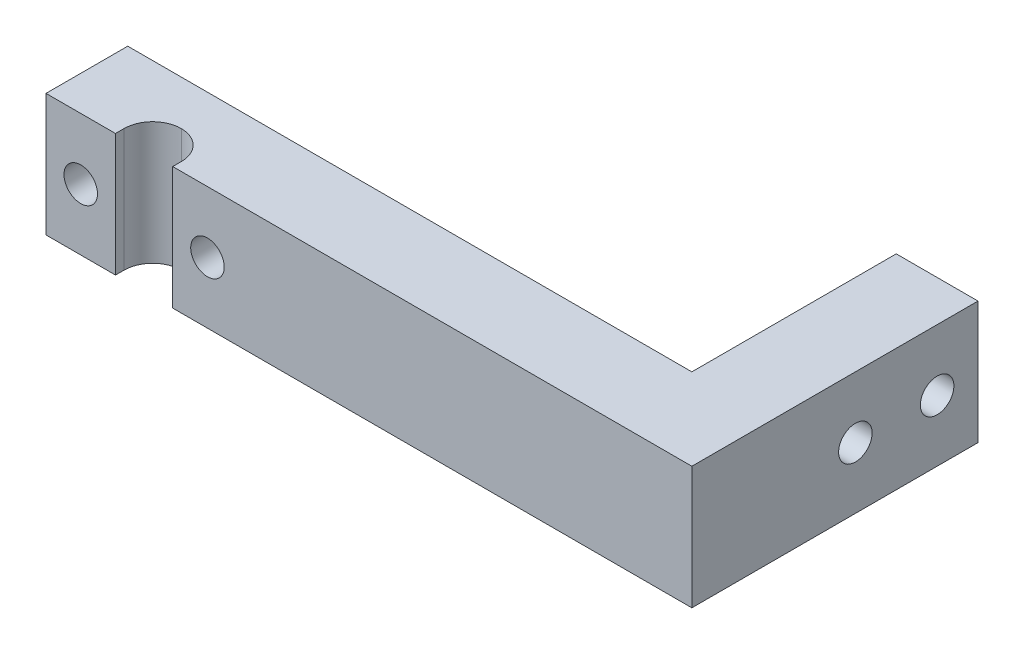
ISO-10303-21;
HEADER;
FILE_DESCRIPTION(('STEP AP214'),'2;1');
FILE_NAME('part.step','',(''),(''),'','','');
FILE_SCHEMA(('AUTOMOTIVE_DESIGN { 1 0 10303 214 1 1 1 1 }'));
ENDSEC;
DATA;
#1=APPLICATION_CONTEXT('core data for automotive mechanical design processes');
#2=APPLICATION_PROTOCOL_DEFINITION('international standard','automotive_design',2000,#1);
#3=PRODUCT_CONTEXT('',#1,'mechanical');
#4=PRODUCT('Part','Part','',(#3));
#5=PRODUCT_RELATED_PRODUCT_CATEGORY('part','',(#4));
#6=PRODUCT_DEFINITION_FORMATION('','',#4);
#7=PRODUCT_DEFINITION_CONTEXT('part definition',#1,'design');
#8=PRODUCT_DEFINITION('design','',#6,#7);
#9=PRODUCT_DEFINITION_SHAPE('','',#8);
#10=(LENGTH_UNIT() NAMED_UNIT(*) SI_UNIT(.MILLI.,.METRE.));
#11=(NAMED_UNIT(*) PLANE_ANGLE_UNIT() SI_UNIT($,.RADIAN.));
#12=(NAMED_UNIT(*) SI_UNIT($,.STERADIAN.) SOLID_ANGLE_UNIT());
#13=UNCERTAINTY_MEASURE_WITH_UNIT(LENGTH_MEASURE(1.E-05),#10,'distance_accuracy_value','');
#14=(GEOMETRIC_REPRESENTATION_CONTEXT(3) GLOBAL_UNCERTAINTY_ASSIGNED_CONTEXT((#13)) GLOBAL_UNIT_ASSIGNED_CONTEXT((#10,
#11,#12)) REPRESENTATION_CONTEXT('',''));
#15=CARTESIAN_POINT('',(0.,0.,0.));
#16=DIRECTION('',(0.,0.,1.));
#17=DIRECTION('',(1.,0.,0.));
#18=AXIS2_PLACEMENT_3D('',#15,#16,#17);
#19=CARTESIAN_POINT('',(-22.986013986014,30.,-8.6013986013986));
#20=DIRECTION('',(1.,0.,0.));
#21=DIRECTION('',(0.,0.,-1.));
#22=AXIS2_PLACEMENT_3D('',#19,#20,#21);
#23=PLANE('',#22);
#24=DIRECTION('',(0.,0.,1.));
#25=VECTOR('',#24,1.);
#26=CARTESIAN_POINT('',(-22.986013986014,0.,-8.6013986013986));
#27=LINE('',#26,#25);
#28=CARTESIAN_POINT('',(-22.986013986014,0.,-8.6013986013986));
#29=VERTEX_POINT('',#28);
#30=CARTESIAN_POINT('',(-22.986013986014,0.,11.3986013986014));
#31=VERTEX_POINT('',#30);
#32=EDGE_CURVE('E160',#29,#31,#27,.T.);
#33=ORIENTED_EDGE('',*,*,#32,.T.);
#34=DIRECTION('',(0.,-1.,0.));
#35=VECTOR('',#34,1.);
#36=CARTESIAN_POINT('',(-22.986013986014,30.,11.3986013986014));
#37=LINE('',#36,#35);
#38=CARTESIAN_POINT('',(-22.986013986014,30.,11.3986013986014));
#39=VERTEX_POINT('',#38);
#40=EDGE_CURVE('E188',#39,#31,#37,.T.);
#41=ORIENTED_EDGE('',*,*,#40,.F.);
#42=DIRECTION('',(0.,0.,1.));
#43=VECTOR('',#42,1.);
#44=CARTESIAN_POINT('',(-22.986013986014,30.,-8.6013986013986));
#45=LINE('',#44,#43);
#46=CARTESIAN_POINT('',(-22.986013986014,30.,-8.6013986013986));
#47=VERTEX_POINT('',#46);
#48=EDGE_CURVE('E128',#47,#39,#45,.T.);
#49=ORIENTED_EDGE('',*,*,#48,.F.);
#50=DIRECTION('',(0.,-1.,0.));
#51=VECTOR('',#50,1.);
#52=CARTESIAN_POINT('',(-22.986013986014,30.,-8.6013986013986));
#53=LINE('',#52,#51);
#54=EDGE_CURVE('E127',#47,#29,#53,.T.);
#55=ORIENTED_EDGE('',*,*,#54,.T.);
#56=EDGE_LOOP('',(#33,#41,#49,#55));
#57=FACE_BOUND('',#56,.T.);
#58=ADVANCED_FACE('F35',(#57),#23,.F.);
#59=CARTESIAN_POINT('',(-22.986013986014,30.,11.3986013986014));
#60=DIRECTION('',(0.,0.,-1.));
#61=DIRECTION('',(-1.,0.,0.));
#62=AXIS2_PLACEMENT_3D('',#59,#60,#61);
#63=PLANE('',#62);
#64=CARTESIAN_POINT('',(-14.486013986014,15.,11.3986013986014));
#65=DIRECTION('',(0.,0.,1.));
#66=DIRECTION('',(1.,0.,0.));
#67=AXIS2_PLACEMENT_3D('',#64,#65,#66);
#68=CIRCLE('',#67,4.1);
#69=CARTESIAN_POINT('',(-10.386013986014,15.,11.3986013986014));
#70=VERTEX_POINT('',#69);
#71=EDGE_CURVE('E155',#70,#70,#68,.T.);
#72=ORIENTED_EDGE('',*,*,#71,.F.);
#73=EDGE_LOOP('',(#72));
#74=FACE_BOUND('',#73,.T.);
#75=DIRECTION('',(1.,0.,0.));
#76=VECTOR('',#75,1.);
#77=CARTESIAN_POINT('',(-22.986013986014,0.,11.3986013986014));
#78=LINE('',#77,#76);
#79=CARTESIAN_POINT('',(-5.98601398601399,0.,11.3986013986014));
#80=VERTEX_POINT('',#79);
#81=EDGE_CURVE('E173',#31,#80,#78,.T.);
#82=ORIENTED_EDGE('',*,*,#81,.T.);
#83=DIRECTION('',(0.,-1.,0.));
#84=VECTOR('',#83,1.);
#85=CARTESIAN_POINT('',(-5.98601398601399,30.,11.3986013986014));
#86=LINE('',#85,#84);
#87=CARTESIAN_POINT('',(-5.98601398601399,30.,11.3986013986014));
#88=VERTEX_POINT('',#87);
#89=EDGE_CURVE('E185',#88,#80,#86,.T.);
#90=ORIENTED_EDGE('',*,*,#89,.F.);
#91=DIRECTION('',(1.,0.,0.));
#92=VECTOR('',#91,1.);
#93=CARTESIAN_POINT('',(-22.986013986014,30.,11.3986013986014));
#94=LINE('',#93,#92);
#95=EDGE_CURVE('E163',#39,#88,#94,.T.);
#96=ORIENTED_EDGE('',*,*,#95,.F.);
#97=ORIENTED_EDGE('',*,*,#40,.T.);
#98=EDGE_LOOP('',(#82,#90,#96,#97));
#99=FACE_BOUND('',#98,.T.);
#100=ADVANCED_FACE('F261',(#74,#99),#63,.F.);
#101=CARTESIAN_POINT('',(-5.98601398601399,30.,11.3986013986014));
#102=DIRECTION('',(-1.,0.,0.));
#103=DIRECTION('',(0.,0.,1.));
#104=AXIS2_PLACEMENT_3D('',#101,#102,#103);
#105=PLANE('',#104);
#106=DIRECTION('',(0.,0.,-1.));
#107=VECTOR('',#106,1.);
#108=CARTESIAN_POINT('',(-5.98601398601399,0.,11.3986013986014));
#109=LINE('',#108,#107);
#110=CARTESIAN_POINT('',(-5.98601398601399,0.,9.30769230769231));
#111=VERTEX_POINT('',#110);
#112=EDGE_CURVE('E175',#80,#111,#109,.T.);
#113=ORIENTED_EDGE('',*,*,#112,.T.);
#114=DIRECTION('',(0.,-1.,0.));
#115=VECTOR('',#114,1.);
#116=CARTESIAN_POINT('',(-5.98601398601399,30.,9.30769230769231));
#117=LINE('',#116,#115);
#118=CARTESIAN_POINT('',(-5.98601398601399,30.,9.30769230769231));
#119=VERTEX_POINT('',#118);
#120=EDGE_CURVE('E192',#111,#119,#117,.F.);
#121=ORIENTED_EDGE('',*,*,#120,.T.);
#122=DIRECTION('',(0.,0.,-1.));
#123=VECTOR('',#122,1.);
#124=CARTESIAN_POINT('',(-5.98601398601399,30.,11.3986013986014));
#125=LINE('',#124,#123);
#126=EDGE_CURVE('E165',#88,#119,#125,.T.);
#127=ORIENTED_EDGE('',*,*,#126,.F.);
#128=ORIENTED_EDGE('',*,*,#89,.T.);
#129=EDGE_LOOP('',(#113,#121,#127,#128));
#130=FACE_BOUND('',#129,.T.);
#131=ADVANCED_FACE('F211',(#130),#105,.F.);
#132=CARTESIAN_POINT('',(8.01398601398601,30.,2.30769230769231));
#133=DIRECTION('',(1.,0.,0.));
#134=DIRECTION('',(0.,0.,-1.));
#135=AXIS2_PLACEMENT_3D('',#132,#133,#134);
#136=PLANE('',#135);
#137=DIRECTION('',(0.,0.,1.));
#138=VECTOR('',#137,1.);
#139=CARTESIAN_POINT('',(8.01398601398601,30.,2.30769230769231));
#140=LINE('',#139,#138);
#141=CARTESIAN_POINT('',(8.01398601398601,30.,9.30769230769231));
#142=VERTEX_POINT('',#141);
#143=CARTESIAN_POINT('',(8.01398601398601,30.,11.3986013986014));
#144=VERTEX_POINT('',#143);
#145=EDGE_CURVE('E167',#142,#144,#140,.T.);
#146=ORIENTED_EDGE('',*,*,#145,.F.);
#147=DIRECTION('',(0.,-1.,0.));
#148=VECTOR('',#147,1.);
#149=CARTESIAN_POINT('',(8.01398601398601,0.,9.30769230769231));
#150=LINE('',#149,#148);
#151=CARTESIAN_POINT('',(8.01398601398601,0.,9.30769230769231));
#152=VERTEX_POINT('',#151);
#153=EDGE_CURVE('E197',#142,#152,#150,.T.);
#154=ORIENTED_EDGE('',*,*,#153,.T.);
#155=DIRECTION('',(0.,0.,1.));
#156=VECTOR('',#155,1.);
#157=CARTESIAN_POINT('',(8.01398601398601,0.,2.30769230769231));
#158=LINE('',#157,#156);
#159=CARTESIAN_POINT('',(8.01398601398601,0.,11.3986013986014));
#160=VERTEX_POINT('',#159);
#161=EDGE_CURVE('E178',#152,#160,#158,.T.);
#162=ORIENTED_EDGE('',*,*,#161,.T.);
#163=DIRECTION('',(0.,-1.,0.));
#164=VECTOR('',#163,1.);
#165=CARTESIAN_POINT('',(8.01398601398601,30.,11.3986013986014));
#166=LINE('',#165,#164);
#167=EDGE_CURVE('E171',#144,#160,#166,.T.);
#168=ORIENTED_EDGE('',*,*,#167,.F.);
#169=EDGE_LOOP('',(#146,#154,#162,#168));
#170=FACE_BOUND('',#169,.T.);
#171=ADVANCED_FACE('F288',(#170),#136,.F.);
#172=CARTESIAN_POINT('',(8.01398601398601,30.,11.3986013986014));
#173=DIRECTION('',(0.,0.,-1.));
#174=DIRECTION('',(-1.,0.,0.));
#175=AXIS2_PLACEMENT_3D('',#172,#173,#174);
#176=PLANE('',#175);
#177=CARTESIAN_POINT('',(16.513986013986,15.,11.3986013986014));
#178=DIRECTION('',(0.,0.,1.));
#179=DIRECTION('',(1.,0.,0.));
#180=AXIS2_PLACEMENT_3D('',#177,#178,#179);
#181=CIRCLE('',#180,4.1);
#182=CARTESIAN_POINT('',(20.613986013986,15.,11.3986013986014));
#183=VERTEX_POINT('',#182);
#184=EDGE_CURVE('E151',#183,#183,#181,.T.);
#185=ORIENTED_EDGE('',*,*,#184,.F.);
#186=EDGE_LOOP('',(#185));
#187=FACE_BOUND('',#186,.T.);
#188=DIRECTION('',(1.,0.,0.));
#189=VECTOR('',#188,1.);
#190=CARTESIAN_POINT('',(8.01398601398601,0.,11.3986013986014));
#191=LINE('',#190,#189);
#192=CARTESIAN_POINT('',(135.013986013986,0.,11.3986013986014));
#193=VERTEX_POINT('',#192);
#194=EDGE_CURVE('E180',#160,#193,#191,.T.);
#195=ORIENTED_EDGE('',*,*,#194,.T.);
#196=DIRECTION('',(0.,-1.,0.));
#197=VECTOR('',#196,1.);
#198=CARTESIAN_POINT('',(135.013986013986,160.384048104053,11.3986013986014));
#199=LINE('',#198,#197);
#200=CARTESIAN_POINT('',(135.013986013986,30.,11.3986013986014));
#201=VERTEX_POINT('',#200);
#202=EDGE_CURVE('E216',#201,#193,#199,.T.);
#203=ORIENTED_EDGE('',*,*,#202,.F.);
#204=DIRECTION('',(1.,0.,0.));
#205=VECTOR('',#204,1.);
#206=CARTESIAN_POINT('',(8.01398601398601,30.,11.3986013986014));
#207=LINE('',#206,#205);
#208=EDGE_CURVE('E169',#144,#201,#207,.T.);
#209=ORIENTED_EDGE('',*,*,#208,.F.);
#210=ORIENTED_EDGE('',*,*,#167,.T.);
#211=EDGE_LOOP('',(#195,#203,#209,#210));
#212=FACE_BOUND('',#211,.T.);
#213=ADVANCED_FACE('F292',(#187,#212),#176,.F.);
#214=CARTESIAN_POINT('',(25.013986013986,30.,-8.6013986013986));
#215=DIRECTION('',(0.,0.,1.));
#216=DIRECTION('',(1.,0.,0.));
#217=AXIS2_PLACEMENT_3D('',#214,#215,#216);
#218=PLANE('',#217);
#219=CARTESIAN_POINT('',(16.513986013986,15.,-8.6013986013986));
#220=DIRECTION('',(0.,0.,1.));
#221=DIRECTION('',(1.,0.,0.));
#222=AXIS2_PLACEMENT_3D('',#219,#220,#221);
#223=CIRCLE('',#222,4.1);
#224=CARTESIAN_POINT('',(20.613986013986,15.,-8.6013986013986));
#225=VERTEX_POINT('',#224);
#226=EDGE_CURVE('E154',#225,#225,#223,.T.);
#227=ORIENTED_EDGE('',*,*,#226,.T.);
#228=EDGE_LOOP('',(#227));
#229=FACE_BOUND('',#228,.T.);
#230=DIRECTION('',(-1.,0.,0.));
#231=VECTOR('',#230,1.);
#232=CARTESIAN_POINT('',(25.013986013986,0.,-8.6013986013986));
#233=LINE('',#232,#231);
#234=CARTESIAN_POINT('',(115.013986013986,0.,-8.60139860139859));
#235=VERTEX_POINT('',#234);
#236=EDGE_CURVE('E129',#235,#29,#233,.T.);
#237=ORIENTED_EDGE('',*,*,#236,.T.);
#238=ORIENTED_EDGE('',*,*,#54,.F.);
#239=DIRECTION('',(-1.,0.,0.));
#240=VECTOR('',#239,1.);
#241=CARTESIAN_POINT('',(-3.98601398601399,30.,-8.6013986013986));
#242=LINE('',#241,#240);
#243=CARTESIAN_POINT('',(115.013986013986,30.,-8.60139860139859));
#244=VERTEX_POINT('',#243);
#245=EDGE_CURVE('E119',#244,#47,#242,.T.);
#246=ORIENTED_EDGE('',*,*,#245,.F.);
#247=DIRECTION('',(0.,-1.,0.));
#248=VECTOR('',#247,1.);
#249=CARTESIAN_POINT('',(115.013986013986,160.384048104053,-8.60139860139859));
#250=LINE('',#249,#248);
#251=EDGE_CURVE('E124',#244,#235,#250,.T.);
#252=ORIENTED_EDGE('',*,*,#251,.T.);
#253=EDGE_LOOP('',(#237,#238,#246,#252));
#254=FACE_BOUND('',#253,.T.);
#255=CARTESIAN_POINT('',(-14.486013986014,15.,-8.6013986013986));
#256=DIRECTION('',(0.,0.,1.));
#257=DIRECTION('',(1.,0.,0.));
#258=AXIS2_PLACEMENT_3D('',#255,#256,#257);
#259=CIRCLE('',#258,4.1);
#260=CARTESIAN_POINT('',(-10.386013986014,15.,-8.6013986013986));
#261=VERTEX_POINT('',#260);
#262=EDGE_CURVE('E158',#261,#261,#259,.T.);
#263=ORIENTED_EDGE('',*,*,#262,.T.);
#264=EDGE_LOOP('',(#263));
#265=FACE_BOUND('',#264,.T.);
#266=ADVANCED_FACE('F121',(#229,#254,#265),#218,.F.);
#267=CARTESIAN_POINT('',(0.,30.,0.));
#268=DIRECTION('',(0.,1.,0.));
#269=DIRECTION('',(0.,0.,1.));
#270=AXIS2_PLACEMENT_3D('',#267,#268,#269);
#271=PLANE('',#270);
#272=DIRECTION('',(0.,0.,-1.));
#273=VECTOR('',#272,1.);
#274=CARTESIAN_POINT('',(115.013986013986,30.,-58.6013986013986));
#275=LINE('',#274,#273);
#276=CARTESIAN_POINT('',(115.013986013986,30.,-58.6013986013986));
#277=VERTEX_POINT('',#276);
#278=EDGE_CURVE('E132',#244,#277,#275,.T.);
#279=ORIENTED_EDGE('',*,*,#278,.F.);
#280=ORIENTED_EDGE('',*,*,#245,.T.);
#281=ORIENTED_EDGE('',*,*,#48,.T.);
#282=ORIENTED_EDGE('',*,*,#95,.T.);
#283=ORIENTED_EDGE('',*,*,#126,.T.);
#284=CARTESIAN_POINT('',(1.01398601398601,30.,9.30769230769231));
#285=DIRECTION('',(0.,1.,0.));
#286=DIRECTION('',(0.,0.,1.));
#287=AXIS2_PLACEMENT_3D('',#284,#285,#286);
#288=CIRCLE('',#287,7.);
#289=CARTESIAN_POINT('',(1.01398601398601,30.,2.30769230769231));
#290=VERTEX_POINT('',#289);
#291=EDGE_CURVE('E50',#119,#290,#288,.F.);
#292=ORIENTED_EDGE('',*,*,#291,.T.);
#293=CARTESIAN_POINT('',(1.01398601398601,30.,9.30769230769231));
#294=DIRECTION('',(0.,1.,0.));
#295=DIRECTION('',(0.,0.,1.));
#296=AXIS2_PLACEMENT_3D('',#293,#294,#295);
#297=CIRCLE('',#296,7.);
#298=EDGE_CURVE('E11',#290,#142,#297,.F.);
#299=ORIENTED_EDGE('',*,*,#298,.T.);
#300=ORIENTED_EDGE('',*,*,#145,.T.);
#301=ORIENTED_EDGE('',*,*,#208,.T.);
#302=DIRECTION('',(0.,0.,1.));
#303=VECTOR('',#302,1.);
#304=CARTESIAN_POINT('',(135.013986013986,30.,11.3986013986014));
#305=LINE('',#304,#303);
#306=CARTESIAN_POINT('',(135.013986013986,30.,-58.6013986013986));
#307=VERTEX_POINT('',#306);
#308=EDGE_CURVE('E218',#307,#201,#305,.T.);
#309=ORIENTED_EDGE('',*,*,#308,.F.);
#310=DIRECTION('',(1.,0.,0.));
#311=VECTOR('',#310,1.);
#312=CARTESIAN_POINT('',(135.013986013986,30.,-58.6013986013986));
#313=LINE('',#312,#311);
#314=EDGE_CURVE('E135',#277,#307,#313,.T.);
#315=ORIENTED_EDGE('',*,*,#314,.F.);
#316=EDGE_LOOP('',(#279,#280,#281,#282,#283,#292,#299,#300,#301,#309,#315));
#317=FACE_BOUND('',#316,.T.);
#318=ADVANCED_FACE('F133',(#317),#271,.T.);
#319=CARTESIAN_POINT('',(0.,0.,0.));
#320=DIRECTION('',(0.,1.,0.));
#321=DIRECTION('',(0.,0.,1.));
#322=AXIS2_PLACEMENT_3D('',#319,#320,#321);
#323=PLANE('',#322);
#324=ORIENTED_EDGE('',*,*,#32,.F.);
#325=ORIENTED_EDGE('',*,*,#236,.F.);
#326=DIRECTION('',(0.,0.,-1.));
#327=VECTOR('',#326,1.);
#328=CARTESIAN_POINT('',(115.013986013986,0.,-58.6013986013986));
#329=LINE('',#328,#327);
#330=CARTESIAN_POINT('',(115.013986013986,0.,-58.6013986013986));
#331=VERTEX_POINT('',#330);
#332=EDGE_CURVE('E142',#235,#331,#329,.T.);
#333=ORIENTED_EDGE('',*,*,#332,.T.);
#334=DIRECTION('',(1.,0.,0.));
#335=VECTOR('',#334,1.);
#336=CARTESIAN_POINT('',(135.013986013986,0.,-58.6013986013986));
#337=LINE('',#336,#335);
#338=CARTESIAN_POINT('',(135.013986013986,0.,-58.6013986013986));
#339=VERTEX_POINT('',#338);
#340=EDGE_CURVE('E146',#331,#339,#337,.T.);
#341=ORIENTED_EDGE('',*,*,#340,.T.);
#342=DIRECTION('',(0.,0.,1.));
#343=VECTOR('',#342,1.);
#344=CARTESIAN_POINT('',(135.013986013986,0.,11.3986013986014));
#345=LINE('',#344,#343);
#346=EDGE_CURVE('E143',#339,#193,#345,.T.);
#347=ORIENTED_EDGE('',*,*,#346,.T.);
#348=ORIENTED_EDGE('',*,*,#194,.F.);
#349=ORIENTED_EDGE('',*,*,#161,.F.);
#350=CARTESIAN_POINT('',(1.01398601398601,0.,9.30769230769231));
#351=DIRECTION('',(0.,1.,0.));
#352=DIRECTION('',(0.,0.,1.));
#353=AXIS2_PLACEMENT_3D('',#350,#351,#352);
#354=CIRCLE('',#353,7.);
#355=CARTESIAN_POINT('',(1.01398601398601,0.,2.30769230769231));
#356=VERTEX_POINT('',#355);
#357=EDGE_CURVE('E44',#152,#356,#354,.T.);
#358=ORIENTED_EDGE('',*,*,#357,.T.);
#359=CARTESIAN_POINT('',(1.01398601398601,0.,9.30769230769231));
#360=DIRECTION('',(0.,1.,0.));
#361=DIRECTION('',(0.,0.,1.));
#362=AXIS2_PLACEMENT_3D('',#359,#360,#361);
#363=CIRCLE('',#362,7.);
#364=EDGE_CURVE('E199',#356,#111,#363,.T.);
#365=ORIENTED_EDGE('',*,*,#364,.T.);
#366=ORIENTED_EDGE('',*,*,#112,.F.);
#367=ORIENTED_EDGE('',*,*,#81,.F.);
#368=EDGE_LOOP('',(#324,#325,#333,#341,#347,#348,#349,#358,#365,#366,#367));
#369=FACE_BOUND('',#368,.T.);
#370=ADVANCED_FACE('F205',(#369),#323,.F.);
#371=CARTESIAN_POINT('',(-14.486013986014,15.,-58.6013986013986));
#372=DIRECTION('',(0.,0.,1.));
#373=DIRECTION('',(1.,0.,0.));
#374=AXIS2_PLACEMENT_3D('',#371,#372,#373);
#375=CYLINDRICAL_SURFACE('',#374,4.1);
#376=ORIENTED_EDGE('',*,*,#71,.T.);
#377=EDGE_LOOP('',(#376));
#378=FACE_BOUND('',#377,.T.);
#379=ORIENTED_EDGE('',*,*,#262,.F.);
#380=EDGE_LOOP('',(#379));
#381=FACE_BOUND('',#380,.T.);
#382=ADVANCED_FACE('F282',(#378,#381),#375,.F.);
#383=CARTESIAN_POINT('',(16.513986013986,15.,-58.6013986013986));
#384=DIRECTION('',(0.,0.,1.));
#385=DIRECTION('',(1.,0.,0.));
#386=AXIS2_PLACEMENT_3D('',#383,#384,#385);
#387=CYLINDRICAL_SURFACE('',#386,4.1);
#388=ORIENTED_EDGE('',*,*,#184,.T.);
#389=EDGE_LOOP('',(#388));
#390=FACE_BOUND('',#389,.T.);
#391=ORIENTED_EDGE('',*,*,#226,.F.);
#392=EDGE_LOOP('',(#391));
#393=FACE_BOUND('',#392,.T.);
#394=ADVANCED_FACE('F278',(#390,#393),#387,.F.);
#395=CARTESIAN_POINT('',(1.01398601398601,30.,9.30769230769231));
#396=DIRECTION('',(0.,1.,0.));
#397=DIRECTION('',(0.,0.,1.));
#398=AXIS2_PLACEMENT_3D('',#395,#396,#397);
#399=CYLINDRICAL_SURFACE('',#398,7.);
#400=ORIENTED_EDGE('',*,*,#153,.F.);
#401=ORIENTED_EDGE('',*,*,#298,.F.);
#402=DIRECTION('',(0.,-1.,0.));
#403=VECTOR('',#402,1.);
#404=CARTESIAN_POINT('',(1.01398601398601,30.,2.30769230769231));
#405=LINE('',#404,#403);
#406=EDGE_CURVE('E39',#356,#290,#405,.F.);
#407=ORIENTED_EDGE('',*,*,#406,.F.);
#408=ORIENTED_EDGE('',*,*,#357,.F.);
#409=EDGE_LOOP('',(#400,#401,#407,#408));
#410=FACE_BOUND('',#409,.T.);
#411=ADVANCED_FACE('F37',(#410),#399,.F.);
#412=CARTESIAN_POINT('',(1.01398601398601,30.,9.30769230769231));
#413=DIRECTION('',(0.,1.,0.));
#414=DIRECTION('',(0.,0.,1.));
#415=AXIS2_PLACEMENT_3D('',#412,#413,#414);
#416=CYLINDRICAL_SURFACE('',#415,7.);
#417=ORIENTED_EDGE('',*,*,#291,.F.);
#418=ORIENTED_EDGE('',*,*,#120,.F.);
#419=ORIENTED_EDGE('',*,*,#364,.F.);
#420=ORIENTED_EDGE('',*,*,#406,.T.);
#421=EDGE_LOOP('',(#417,#418,#419,#420));
#422=FACE_BOUND('',#421,.T.);
#423=ADVANCED_FACE('F214',(#422),#416,.F.);
#424=CARTESIAN_POINT('',(115.013986013986,160.384048104053,-58.6013986013986));
#425=DIRECTION('',(-1.,0.,0.));
#426=DIRECTION('',(0.,0.,1.));
#427=AXIS2_PLACEMENT_3D('',#424,#425,#426);
#428=PLANE('',#427);
#429=CARTESIAN_POINT('',(115.013986013986,15.,-28.6013986013986));
#430=DIRECTION('',(-1.,0.,0.));
#431=DIRECTION('',(0.,0.,1.));
#432=AXIS2_PLACEMENT_3D('',#429,#430,#431);
#433=CIRCLE('',#432,4.1);
#434=CARTESIAN_POINT('',(115.013986013986,15.,-24.5013986013986));
#435=VERTEX_POINT('',#434);
#436=EDGE_CURVE('E240',#435,#435,#433,.T.);
#437=ORIENTED_EDGE('',*,*,#436,.F.);
#438=EDGE_LOOP('',(#437));
#439=FACE_BOUND('',#438,.T.);
#440=CARTESIAN_POINT('',(115.013986013986,15.,-48.6013986013986));
#441=DIRECTION('',(-1.,0.,0.));
#442=DIRECTION('',(0.,0.,1.));
#443=AXIS2_PLACEMENT_3D('',#440,#441,#442);
#444=CIRCLE('',#443,4.1);
#445=CARTESIAN_POINT('',(115.013986013986,15.,-44.5013986013986));
#446=VERTEX_POINT('',#445);
#447=EDGE_CURVE('E232',#446,#446,#444,.T.);
#448=ORIENTED_EDGE('',*,*,#447,.F.);
#449=EDGE_LOOP('',(#448));
#450=FACE_BOUND('',#449,.T.);
#451=ORIENTED_EDGE('',*,*,#251,.F.);
#452=ORIENTED_EDGE('',*,*,#278,.T.);
#453=DIRECTION('',(0.,-1.,0.));
#454=VECTOR('',#453,1.);
#455=CARTESIAN_POINT('',(115.013986013986,160.384048104053,-58.6013986013986));
#456=LINE('',#455,#454);
#457=EDGE_CURVE('E138',#277,#331,#456,.T.);
#458=ORIENTED_EDGE('',*,*,#457,.T.);
#459=ORIENTED_EDGE('',*,*,#332,.F.);
#460=EDGE_LOOP('',(#451,#452,#458,#459));
#461=FACE_BOUND('',#460,.T.);
#462=ADVANCED_FACE('F140',(#439,#450,#461),#428,.T.);
#463=CARTESIAN_POINT('',(135.013986013986,160.384048104053,-58.6013986013986));
#464=DIRECTION('',(0.,0.,-1.));
#465=DIRECTION('',(-1.,0.,0.));
#466=AXIS2_PLACEMENT_3D('',#463,#464,#465);
#467=PLANE('',#466);
#468=ORIENTED_EDGE('',*,*,#457,.F.);
#469=ORIENTED_EDGE('',*,*,#314,.T.);
#470=DIRECTION('',(0.,-1.,0.));
#471=VECTOR('',#470,1.);
#472=CARTESIAN_POINT('',(135.013986013986,160.384048104053,-58.6013986013986));
#473=LINE('',#472,#471);
#474=EDGE_CURVE('E224',#307,#339,#473,.T.);
#475=ORIENTED_EDGE('',*,*,#474,.T.);
#476=ORIENTED_EDGE('',*,*,#340,.F.);
#477=EDGE_LOOP('',(#468,#469,#475,#476));
#478=FACE_BOUND('',#477,.T.);
#479=ADVANCED_FACE('F275',(#478),#467,.T.);
#480=CARTESIAN_POINT('',(135.013986013986,160.384048104053,11.3986013986014));
#481=DIRECTION('',(1.,0.,0.));
#482=DIRECTION('',(0.,0.,-1.));
#483=AXIS2_PLACEMENT_3D('',#480,#481,#482);
#484=PLANE('',#483);
#485=CARTESIAN_POINT('',(135.013986013986,15.,-28.6013986013986));
#486=DIRECTION('',(-1.,0.,0.));
#487=DIRECTION('',(0.,0.,1.));
#488=AXIS2_PLACEMENT_3D('',#485,#486,#487);
#489=CIRCLE('',#488,4.1);
#490=CARTESIAN_POINT('',(135.013986013986,15.,-24.5013986013986));
#491=VERTEX_POINT('',#490);
#492=EDGE_CURVE('E243',#491,#491,#489,.T.);
#493=ORIENTED_EDGE('',*,*,#492,.T.);
#494=EDGE_LOOP('',(#493));
#495=FACE_BOUND('',#494,.T.);
#496=CARTESIAN_POINT('',(135.013986013986,15.,-48.6013986013986));
#497=DIRECTION('',(-1.,0.,0.));
#498=DIRECTION('',(0.,0.,1.));
#499=AXIS2_PLACEMENT_3D('',#496,#497,#498);
#500=CIRCLE('',#499,4.1);
#501=CARTESIAN_POINT('',(135.013986013986,15.,-44.5013986013986));
#502=VERTEX_POINT('',#501);
#503=EDGE_CURVE('E237',#502,#502,#500,.T.);
#504=ORIENTED_EDGE('',*,*,#503,.T.);
#505=EDGE_LOOP('',(#504));
#506=FACE_BOUND('',#505,.T.);
#507=ORIENTED_EDGE('',*,*,#474,.F.);
#508=ORIENTED_EDGE('',*,*,#308,.T.);
#509=ORIENTED_EDGE('',*,*,#202,.T.);
#510=ORIENTED_EDGE('',*,*,#346,.F.);
#511=EDGE_LOOP('',(#507,#508,#509,#510));
#512=FACE_BOUND('',#511,.T.);
#513=ADVANCED_FACE('F247',(#495,#506,#512),#484,.T.);
#514=CARTESIAN_POINT('',(135.013986013986,15.,-48.6013986013986));
#515=DIRECTION('',(-1.,0.,0.));
#516=DIRECTION('',(0.,0.,1.));
#517=AXIS2_PLACEMENT_3D('',#514,#515,#516);
#518=CYLINDRICAL_SURFACE('',#517,4.1);
#519=ORIENTED_EDGE('',*,*,#447,.T.);
#520=EDGE_LOOP('',(#519));
#521=FACE_BOUND('',#520,.T.);
#522=ORIENTED_EDGE('',*,*,#503,.F.);
#523=EDGE_LOOP('',(#522));
#524=FACE_BOUND('',#523,.T.);
#525=ADVANCED_FACE('F252',(#521,#524),#518,.F.);
#526=CARTESIAN_POINT('',(135.013986013986,15.,-28.6013986013986));
#527=DIRECTION('',(-1.,0.,0.));
#528=DIRECTION('',(0.,0.,1.));
#529=AXIS2_PLACEMENT_3D('',#526,#527,#528);
#530=CYLINDRICAL_SURFACE('',#529,4.1);
#531=ORIENTED_EDGE('',*,*,#436,.T.);
#532=EDGE_LOOP('',(#531));
#533=FACE_BOUND('',#532,.T.);
#534=ORIENTED_EDGE('',*,*,#492,.F.);
#535=EDGE_LOOP('',(#534));
#536=FACE_BOUND('',#535,.T.);
#537=ADVANCED_FACE('F250',(#533,#536),#530,.F.);
#538=CLOSED_SHELL('',(#58,#100,#131,#171,#213,#266,#318,#370,#382,#394,#411,#423,#462,#479,#513,
#525,#537));
#539=MANIFOLD_SOLID_BREP('B2',#538);
#540=ADVANCED_BREP_SHAPE_REPRESENTATION('',(#18,#539),#14);
#541=SHAPE_DEFINITION_REPRESENTATION(#9,#540);
ENDSEC;
END-ISO-10303-21;
